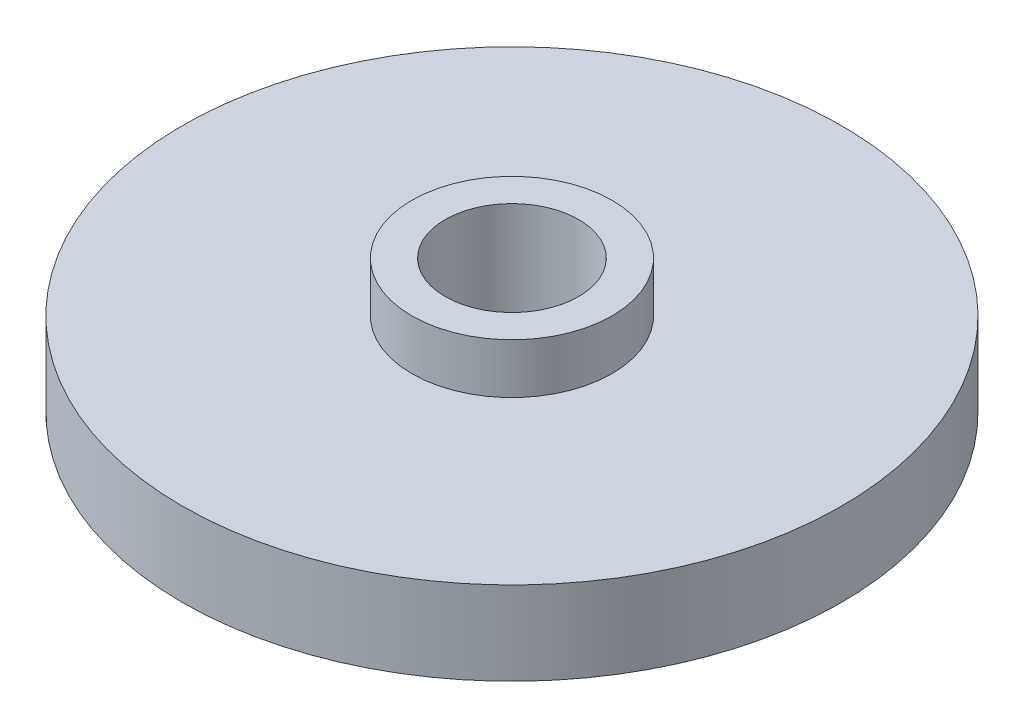
ISO-10303-21;
HEADER;
FILE_DESCRIPTION(('STEP AP214'),'2;1');
FILE_NAME('part.step','',(''),(''),'','','');
FILE_SCHEMA(('AUTOMOTIVE_DESIGN { 1 0 10303 214 1 1 1 1 }'));
ENDSEC;
DATA;
#1=APPLICATION_CONTEXT('core data for automotive mechanical design processes');
#2=APPLICATION_PROTOCOL_DEFINITION('international standard','automotive_design',2000,#1);
#3=PRODUCT_CONTEXT('',#1,'mechanical');
#4=PRODUCT('Part','Part','',(#3));
#5=PRODUCT_RELATED_PRODUCT_CATEGORY('part','',(#4));
#6=PRODUCT_DEFINITION_FORMATION('','',#4);
#7=PRODUCT_DEFINITION_CONTEXT('part definition',#1,'design');
#8=PRODUCT_DEFINITION('design','',#6,#7);
#9=PRODUCT_DEFINITION_SHAPE('','',#8);
#10=(LENGTH_UNIT() NAMED_UNIT(*) SI_UNIT(.MILLI.,.METRE.));
#11=(NAMED_UNIT(*) PLANE_ANGLE_UNIT() SI_UNIT($,.RADIAN.));
#12=(NAMED_UNIT(*) SI_UNIT($,.STERADIAN.) SOLID_ANGLE_UNIT());
#13=UNCERTAINTY_MEASURE_WITH_UNIT(LENGTH_MEASURE(1.E-05),#10,'distance_accuracy_value','');
#14=(GEOMETRIC_REPRESENTATION_CONTEXT(3) GLOBAL_UNCERTAINTY_ASSIGNED_CONTEXT((#13)) GLOBAL_UNIT_ASSIGNED_CONTEXT((#10,
#11,#12)) REPRESENTATION_CONTEXT('',''));
#15=CARTESIAN_POINT('',(0.,0.,0.));
#16=DIRECTION('',(0.,0.,1.));
#17=DIRECTION('',(1.,0.,0.));
#18=AXIS2_PLACEMENT_3D('',#15,#16,#17);
#19=CARTESIAN_POINT('',(0.,8.,0.));
#20=DIRECTION('',(0.,-1.,0.));
#21=DIRECTION('',(0.,0.,-1.));
#22=AXIS2_PLACEMENT_3D('',#19,#20,#21);
#23=CYLINDRICAL_SURFACE('',#22,1.6);
#24=CARTESIAN_POINT('',(0.,0.2,0.));
#25=DIRECTION('',(0.,-1.,0.));
#26=DIRECTION('',(0.,0.,-1.));
#27=AXIS2_PLACEMENT_3D('',#24,#25,#26);
#28=CIRCLE('',#27,1.6);
#29=CARTESIAN_POINT('',(0.,0.2,-1.6));
#30=VERTEX_POINT('',#29);
#31=EDGE_CURVE('E59',#30,#30,#28,.F.);
#32=ORIENTED_EDGE('',*,*,#31,.F.);
#33=EDGE_LOOP('',(#32));
#34=FACE_BOUND('',#33,.T.);
#35=CARTESIAN_POINT('',(0.,2.2,0.));
#36=DIRECTION('',(0.,1.,0.));
#37=DIRECTION('',(0.,0.,1.));
#38=AXIS2_PLACEMENT_3D('',#35,#36,#37);
#39=CIRCLE('',#38,1.6);
#40=CARTESIAN_POINT('',(0.,2.2,1.6));
#41=VERTEX_POINT('',#40);
#42=EDGE_CURVE('E37',#41,#41,#39,.F.);
#43=ORIENTED_EDGE('',*,*,#42,.F.);
#44=EDGE_LOOP('',(#43));
#45=FACE_BOUND('',#44,.T.);
#46=ADVANCED_FACE('F33',(#34,#45),#23,.F.);
#47=CARTESIAN_POINT('',(0.,5.,0.));
#48=DIRECTION('',(0.,-1.,0.));
#49=DIRECTION('',(0.,0.,-1.));
#50=AXIS2_PLACEMENT_3D('',#47,#48,#49);
#51=CYLINDRICAL_SURFACE('',#50,19.75);
#52=CARTESIAN_POINT('',(0.,5.,0.));
#53=DIRECTION('',(0.,1.,0.));
#54=DIRECTION('',(0.,0.,1.));
#55=AXIS2_PLACEMENT_3D('',#52,#53,#54);
#56=CIRCLE('',#55,19.75);
#57=CARTESIAN_POINT('',(0.,5.,19.75));
#58=VERTEX_POINT('',#57);
#59=EDGE_CURVE('E46',#58,#58,#56,.T.);
#60=ORIENTED_EDGE('',*,*,#59,.F.);
#61=EDGE_LOOP('',(#60));
#62=FACE_BOUND('',#61,.T.);
#63=CARTESIAN_POINT('',(0.,0.,0.));
#64=DIRECTION('',(0.,1.,0.));
#65=DIRECTION('',(0.,0.,1.));
#66=AXIS2_PLACEMENT_3D('',#63,#64,#65);
#67=CIRCLE('',#66,19.75);
#68=CARTESIAN_POINT('',(0.,0.,19.75));
#69=VERTEX_POINT('',#68);
#70=EDGE_CURVE('E54',#69,#69,#67,.T.);
#71=ORIENTED_EDGE('',*,*,#70,.T.);
#72=EDGE_LOOP('',(#71));
#73=FACE_BOUND('',#72,.T.);
#74=ADVANCED_FACE('F35',(#62,#73),#51,.T.);
#75=CARTESIAN_POINT('',(0.,5.,0.));
#76=DIRECTION('',(0.,1.,0.));
#77=DIRECTION('',(0.,0.,1.));
#78=AXIS2_PLACEMENT_3D('',#75,#76,#77);
#79=PLANE('',#78);
#80=CARTESIAN_POINT('',(0.,5.,0.));
#81=DIRECTION('',(0.,1.,0.));
#82=DIRECTION('',(0.,0.,1.));
#83=AXIS2_PLACEMENT_3D('',#80,#81,#82);
#84=CIRCLE('',#83,6.);
#85=CARTESIAN_POINT('',(0.,5.,6.));
#86=VERTEX_POINT('',#85);
#87=EDGE_CURVE('E41',#86,#86,#84,.T.);
#88=ORIENTED_EDGE('',*,*,#87,.F.);
#89=EDGE_LOOP('',(#88));
#90=FACE_BOUND('',#89,.T.);
#91=ORIENTED_EDGE('',*,*,#59,.T.);
#92=EDGE_LOOP('',(#91));
#93=FACE_BOUND('',#92,.T.);
#94=ADVANCED_FACE('F90',(#90,#93),#79,.T.);
#95=CARTESIAN_POINT('',(0.,0.,0.));
#96=DIRECTION('',(0.,1.,0.));
#97=DIRECTION('',(0.,0.,1.));
#98=AXIS2_PLACEMENT_3D('',#95,#96,#97);
#99=PLANE('',#98);
#100=CARTESIAN_POINT('',(0.,0.,0.));
#101=DIRECTION('',(0.,-1.,0.));
#102=DIRECTION('',(0.,0.,-1.));
#103=AXIS2_PLACEMENT_3D('',#100,#101,#102);
#104=CIRCLE('',#103,4.7);
#105=CARTESIAN_POINT('',(0.,0.,-4.7));
#106=VERTEX_POINT('',#105);
#107=EDGE_CURVE('E10',#106,#106,#104,.T.);
#108=ORIENTED_EDGE('',*,*,#107,.F.);
#109=EDGE_LOOP('',(#108));
#110=FACE_BOUND('',#109,.T.);
#111=ORIENTED_EDGE('',*,*,#70,.F.);
#112=EDGE_LOOP('',(#111));
#113=FACE_BOUND('',#112,.T.);
#114=ADVANCED_FACE('F112',(#110,#113),#99,.F.);
#115=CARTESIAN_POINT('',(0.,8.,0.));
#116=DIRECTION('',(0.,-1.,0.));
#117=DIRECTION('',(0.,0.,-1.));
#118=AXIS2_PLACEMENT_3D('',#115,#116,#117);
#119=CYLINDRICAL_SURFACE('',#118,6.);
#120=CARTESIAN_POINT('',(0.,8.,0.));
#121=DIRECTION('',(0.,1.,0.));
#122=DIRECTION('',(0.,0.,1.));
#123=AXIS2_PLACEMENT_3D('',#120,#121,#122);
#124=CIRCLE('',#123,6.);
#125=CARTESIAN_POINT('',(0.,8.,6.));
#126=VERTEX_POINT('',#125);
#127=EDGE_CURVE('E52',#126,#126,#124,.T.);
#128=ORIENTED_EDGE('',*,*,#127,.F.);
#129=EDGE_LOOP('',(#128));
#130=FACE_BOUND('',#129,.T.);
#131=ORIENTED_EDGE('',*,*,#87,.T.);
#132=EDGE_LOOP('',(#131));
#133=FACE_BOUND('',#132,.T.);
#134=ADVANCED_FACE('F108',(#130,#133),#119,.T.);
#135=CARTESIAN_POINT('',(0.,8.,0.));
#136=DIRECTION('',(0.,1.,0.));
#137=DIRECTION('',(0.,0.,1.));
#138=AXIS2_PLACEMENT_3D('',#135,#136,#137);
#139=PLANE('',#138);
#140=CARTESIAN_POINT('',(0.,8.,0.));
#141=DIRECTION('',(0.,1.,0.));
#142=DIRECTION('',(0.,0.,1.));
#143=AXIS2_PLACEMENT_3D('',#140,#141,#142);
#144=CIRCLE('',#143,4.);
#145=CARTESIAN_POINT('',(0.,8.,4.));
#146=VERTEX_POINT('',#145);
#147=EDGE_CURVE('E72',#146,#146,#144,.T.);
#148=ORIENTED_EDGE('',*,*,#147,.F.);
#149=EDGE_LOOP('',(#148));
#150=FACE_BOUND('',#149,.T.);
#151=ORIENTED_EDGE('',*,*,#127,.T.);
#152=EDGE_LOOP('',(#151));
#153=FACE_BOUND('',#152,.T.);
#154=ADVANCED_FACE('F104',(#150,#153),#139,.T.);
#155=CARTESIAN_POINT('',(0.,-0.65,0.));
#156=DIRECTION('',(0.,1.,0.));
#157=DIRECTION('',(0.,0.,1.));
#158=AXIS2_PLACEMENT_3D('',#155,#156,#157);
#159=CYLINDRICAL_SURFACE('',#158,4.7);
#160=CARTESIAN_POINT('',(0.,-0.65,0.));
#161=DIRECTION('',(0.,-1.,0.));
#162=DIRECTION('',(0.,0.,-1.));
#163=AXIS2_PLACEMENT_3D('',#160,#161,#162);
#164=CIRCLE('',#163,4.7);
#165=CARTESIAN_POINT('',(0.,-0.65,-4.7));
#166=VERTEX_POINT('',#165);
#167=EDGE_CURVE('E50',#166,#166,#164,.T.);
#168=ORIENTED_EDGE('',*,*,#167,.F.);
#169=EDGE_LOOP('',(#168));
#170=FACE_BOUND('',#169,.T.);
#171=ORIENTED_EDGE('',*,*,#107,.T.);
#172=EDGE_LOOP('',(#171));
#173=FACE_BOUND('',#172,.T.);
#174=ADVANCED_FACE('F100',(#170,#173),#159,.T.);
#175=CARTESIAN_POINT('',(0.,-0.65,0.));
#176=DIRECTION('',(0.,-1.,0.));
#177=DIRECTION('',(0.,0.,-1.));
#178=AXIS2_PLACEMENT_3D('',#175,#176,#177);
#179=PLANE('',#178);
#180=CARTESIAN_POINT('',(0.,-0.65,0.));
#181=DIRECTION('',(0.,-1.,0.));
#182=DIRECTION('',(0.,0.,-1.));
#183=AXIS2_PLACEMENT_3D('',#180,#181,#182);
#184=CIRCLE('',#183,3.85);
#185=CARTESIAN_POINT('',(0.,-0.65,-3.85));
#186=VERTEX_POINT('',#185);
#187=EDGE_CURVE('E66',#186,#186,#184,.T.);
#188=ORIENTED_EDGE('',*,*,#187,.F.);
#189=EDGE_LOOP('',(#188));
#190=FACE_BOUND('',#189,.T.);
#191=ORIENTED_EDGE('',*,*,#167,.T.);
#192=EDGE_LOOP('',(#191));
#193=FACE_BOUND('',#192,.T.);
#194=ADVANCED_FACE('F96',(#190,#193),#179,.T.);
#195=CARTESIAN_POINT('',(0.,0.2,0.));
#196=DIRECTION('',(0.,-1.,0.));
#197=DIRECTION('',(0.,0.,-1.));
#198=AXIS2_PLACEMENT_3D('',#195,#196,#197);
#199=PLANE('',#198);
#200=CARTESIAN_POINT('',(0.,0.2,0.));
#201=DIRECTION('',(0.,-1.,0.));
#202=DIRECTION('',(0.,0.,-1.));
#203=AXIS2_PLACEMENT_3D('',#200,#201,#202);
#204=CIRCLE('',#203,3.85);
#205=CARTESIAN_POINT('',(0.,0.2,-3.85));
#206=VERTEX_POINT('',#205);
#207=EDGE_CURVE('E61',#206,#206,#204,.T.);
#208=ORIENTED_EDGE('',*,*,#207,.T.);
#209=EDGE_LOOP('',(#208));
#210=FACE_BOUND('',#209,.T.);
#211=ORIENTED_EDGE('',*,*,#31,.T.);
#212=EDGE_LOOP('',(#211));
#213=FACE_BOUND('',#212,.T.);
#214=ADVANCED_FACE('F99',(#210,#213),#199,.T.);
#215=CARTESIAN_POINT('',(0.,0.2,0.));
#216=DIRECTION('',(0.,-1.,0.));
#217=DIRECTION('',(0.,0.,-1.));
#218=AXIS2_PLACEMENT_3D('',#215,#216,#217);
#219=CYLINDRICAL_SURFACE('',#218,3.85);
#220=ORIENTED_EDGE('',*,*,#207,.F.);
#221=EDGE_LOOP('',(#220));
#222=FACE_BOUND('',#221,.T.);
#223=ORIENTED_EDGE('',*,*,#187,.T.);
#224=EDGE_LOOP('',(#223));
#225=FACE_BOUND('',#224,.T.);
#226=ADVANCED_FACE('F94',(#222,#225),#219,.F.);
#227=CARTESIAN_POINT('',(0.,2.2,0.));
#228=DIRECTION('',(0.,1.,0.));
#229=DIRECTION('',(0.,0.,1.));
#230=AXIS2_PLACEMENT_3D('',#227,#228,#229);
#231=PLANE('',#230);
#232=CARTESIAN_POINT('',(0.,2.2,0.));
#233=DIRECTION('',(0.,1.,0.));
#234=DIRECTION('',(0.,0.,1.));
#235=AXIS2_PLACEMENT_3D('',#232,#233,#234);
#236=CIRCLE('',#235,4.);
#237=CARTESIAN_POINT('',(0.,2.2,4.));
#238=VERTEX_POINT('',#237);
#239=EDGE_CURVE('E75',#238,#238,#236,.T.);
#240=ORIENTED_EDGE('',*,*,#239,.T.);
#241=EDGE_LOOP('',(#240));
#242=FACE_BOUND('',#241,.T.);
#243=ORIENTED_EDGE('',*,*,#42,.T.);
#244=EDGE_LOOP('',(#243));
#245=FACE_BOUND('',#244,.T.);
#246=ADVANCED_FACE('F82',(#242,#245),#231,.T.);
#247=CARTESIAN_POINT('',(0.,2.2,0.));
#248=DIRECTION('',(0.,1.,0.));
#249=DIRECTION('',(0.,0.,1.));
#250=AXIS2_PLACEMENT_3D('',#247,#248,#249);
#251=CYLINDRICAL_SURFACE('',#250,4.);
#252=ORIENTED_EDGE('',*,*,#239,.F.);
#253=EDGE_LOOP('',(#252));
#254=FACE_BOUND('',#253,.T.);
#255=ORIENTED_EDGE('',*,*,#147,.T.);
#256=EDGE_LOOP('',(#255));
#257=FACE_BOUND('',#256,.T.);
#258=ADVANCED_FACE('F158',(#254,#257),#251,.F.);
#259=CLOSED_SHELL('',(#46,#74,#94,#114,#134,#154,#174,#194,#214,#226,#246,#258));
#260=MANIFOLD_SOLID_BREP('B2',#259);
#261=ADVANCED_BREP_SHAPE_REPRESENTATION('',(#18,#260),#14);
#262=SHAPE_DEFINITION_REPRESENTATION(#9,#261);
ENDSEC;
END-ISO-10303-21;
